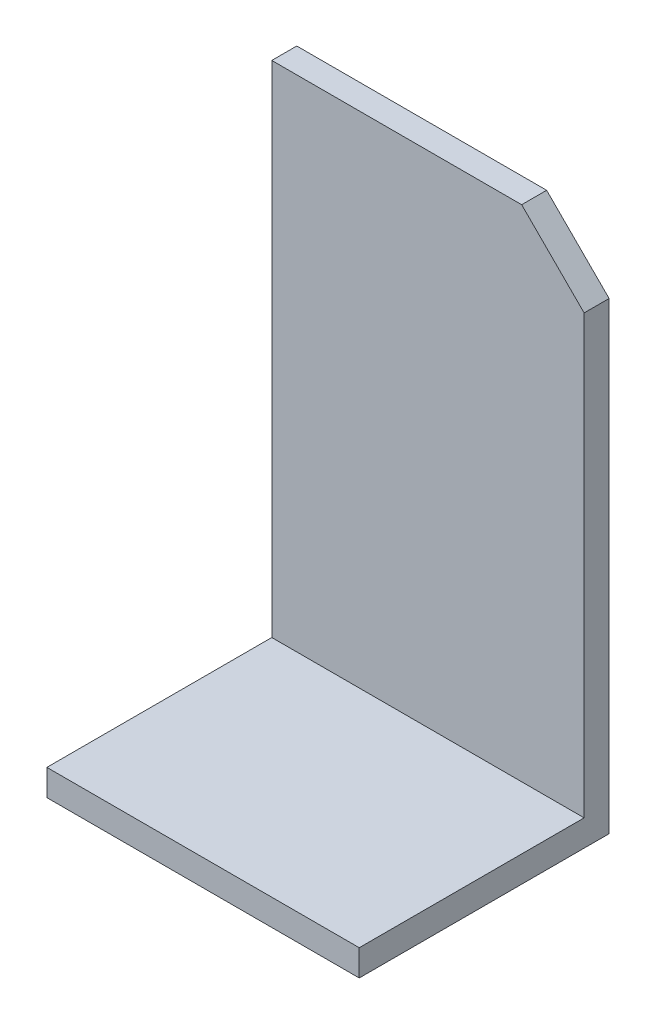
ISO-10303-21;
HEADER;
FILE_DESCRIPTION(('STEP AP214'),'2;1');
FILE_NAME('part.step','',(''),(''),'','','');
FILE_SCHEMA(('AUTOMOTIVE_DESIGN { 1 0 10303 214 1 1 1 1 }'));
ENDSEC;
DATA;
#1=APPLICATION_CONTEXT('core data for automotive mechanical design processes');
#2=APPLICATION_PROTOCOL_DEFINITION('international standard','automotive_design',2000,#1);
#3=PRODUCT_CONTEXT('',#1,'mechanical');
#4=PRODUCT('Part','Part','',(#3));
#5=PRODUCT_RELATED_PRODUCT_CATEGORY('part','',(#4));
#6=PRODUCT_DEFINITION_FORMATION('','',#4);
#7=PRODUCT_DEFINITION_CONTEXT('part definition',#1,'design');
#8=PRODUCT_DEFINITION('design','',#6,#7);
#9=PRODUCT_DEFINITION_SHAPE('','',#8);
#10=(LENGTH_UNIT() NAMED_UNIT(*) SI_UNIT(.MILLI.,.METRE.));
#11=(NAMED_UNIT(*) PLANE_ANGLE_UNIT() SI_UNIT($,.RADIAN.));
#12=(NAMED_UNIT(*) SI_UNIT($,.STERADIAN.) SOLID_ANGLE_UNIT());
#13=UNCERTAINTY_MEASURE_WITH_UNIT(LENGTH_MEASURE(1.E-05),#10,'distance_accuracy_value','');
#14=(GEOMETRIC_REPRESENTATION_CONTEXT(3) GLOBAL_UNCERTAINTY_ASSIGNED_CONTEXT((#13)) GLOBAL_UNIT_ASSIGNED_CONTEXT((#10,
#11,#12)) REPRESENTATION_CONTEXT('',''));
#15=CARTESIAN_POINT('',(0.,0.,0.));
#16=DIRECTION('',(0.,0.,1.));
#17=DIRECTION('',(1.,0.,0.));
#18=AXIS2_PLACEMENT_3D('',#15,#16,#17);
#19=CARTESIAN_POINT('',(0.72167930040457,-1.5105,0.2));
#20=DIRECTION('',(0.,0.,1.));
#21=DIRECTION('',(0.,-1.,0.));
#22=AXIS2_PLACEMENT_3D('',#19,#20,#21);
#23=PLANE('',#22);
#24=DIRECTION('',(0.,-1.,0.));
#25=VECTOR('',#24,1.);
#26=CARTESIAN_POINT('',(0.59667930040457,-1.36847101449275,0.2));
#27=LINE('',#26,#25);
#28=CARTESIAN_POINT('',(0.59667930040457,-1.5,0.2));
#29=VERTEX_POINT('',#28);
#30=CARTESIAN_POINT('',(0.59667930040457,-1.521,0.2));
#31=VERTEX_POINT('',#30);
#32=EDGE_CURVE('E124',#29,#31,#27,.T.);
#33=ORIENTED_EDGE('',*,*,#32,.T.);
#34=DIRECTION('',(1.,0.,0.));
#35=VECTOR('',#34,1.);
#36=CARTESIAN_POINT('',(0.72167930040457,-1.521,0.2));
#37=LINE('',#36,#35);
#38=CARTESIAN_POINT('',(0.84667930040457,-1.521,0.2));
#39=VERTEX_POINT('',#38);
#40=EDGE_CURVE('E95',#31,#39,#37,.T.);
#41=ORIENTED_EDGE('',*,*,#40,.T.);
#42=DIRECTION('',(0.,-1.,0.));
#43=VECTOR('',#42,1.);
#44=CARTESIAN_POINT('',(0.846679300404568,-1.39066637478108,0.2));
#45=LINE('',#44,#43);
#46=CARTESIAN_POINT('',(0.846679300404569,-1.5,0.2));
#47=VERTEX_POINT('',#46);
#48=EDGE_CURVE('E93',#47,#39,#45,.T.);
#49=ORIENTED_EDGE('',*,*,#48,.F.);
#50=DIRECTION('',(1.,0.,0.));
#51=VECTOR('',#50,1.);
#52=CARTESIAN_POINT('',(0.72167930040457,-1.5,0.2));
#53=LINE('',#52,#51);
#54=EDGE_CURVE('E21',#29,#47,#53,.T.);
#55=ORIENTED_EDGE('',*,*,#54,.F.);
#56=EDGE_LOOP('',(#33,#41,#49,#55));
#57=FACE_BOUND('',#56,.T.);
#58=ADVANCED_FACE('F17',(#57),#23,.T.);
#59=CARTESIAN_POINT('',(0.718390642915422,-1.30501737448108,0.02));
#60=DIRECTION('',(0.,0.,1.));
#61=DIRECTION('',(0.,-1.,0.));
#62=AXIS2_PLACEMENT_3D('',#59,#60,#61);
#63=PLANE('',#62);
#64=DIRECTION('',(1.,0.,0.));
#65=VECTOR('',#64,1.);
#66=CARTESIAN_POINT('',(0.696679300404569,-1.1,0.02));
#67=LINE('',#66,#65);
#68=CARTESIAN_POINT('',(0.59667930040457,-1.1,0.02));
#69=VERTEX_POINT('',#68);
#70=CARTESIAN_POINT('',(0.796679300404568,-1.1,0.02));
#71=VERTEX_POINT('',#70);
#72=EDGE_CURVE('E50',#69,#71,#67,.T.);
#73=ORIENTED_EDGE('',*,*,#72,.F.);
#74=DIRECTION('',(0.,-1.,0.));
#75=VECTOR('',#74,1.);
#76=CARTESIAN_POINT('',(0.59667930040457,-1.36847101449275,0.02));
#77=LINE('',#76,#75);
#78=CARTESIAN_POINT('',(0.59667930040457,-1.5,0.02));
#79=VERTEX_POINT('',#78);
#80=EDGE_CURVE('E129',#69,#79,#77,.T.);
#81=ORIENTED_EDGE('',*,*,#80,.T.);
#82=DIRECTION('',(-1.,0.,0.));
#83=VECTOR('',#82,1.);
#84=CARTESIAN_POINT('',(0.72167930040457,-1.5,0.02));
#85=LINE('',#84,#83);
#86=CARTESIAN_POINT('',(0.846679300404569,-1.5,0.02));
#87=VERTEX_POINT('',#86);
#88=EDGE_CURVE('E11',#87,#79,#85,.T.);
#89=ORIENTED_EDGE('',*,*,#88,.F.);
#90=DIRECTION('',(0.,-1.,0.));
#91=VECTOR('',#90,1.);
#92=CARTESIAN_POINT('',(0.846679300404568,-1.39066637478108,0.02));
#93=LINE('',#92,#91);
#94=CARTESIAN_POINT('',(0.846679300404569,-1.15,0.02));
#95=VERTEX_POINT('',#94);
#96=EDGE_CURVE('E104',#95,#87,#93,.T.);
#97=ORIENTED_EDGE('',*,*,#96,.F.);
#98=DIRECTION('',(0.707106781186548,-0.707106781186547,0.));
#99=VECTOR('',#98,1.);
#100=CARTESIAN_POINT('',(0.821679300404569,-1.125,0.02));
#101=LINE('',#100,#99);
#102=EDGE_CURVE('E40',#71,#95,#101,.T.);
#103=ORIENTED_EDGE('',*,*,#102,.F.);
#104=EDGE_LOOP('',(#73,#81,#89,#97,#103));
#105=FACE_BOUND('',#104,.T.);
#106=ADVANCED_FACE('F19',(#105),#63,.T.);
#107=CARTESIAN_POINT('',(0.72167930040457,-1.5,0.11));
#108=DIRECTION('',(0.,1.,0.));
#109=DIRECTION('',(1.,0.,0.));
#110=AXIS2_PLACEMENT_3D('',#107,#108,#109);
#111=PLANE('',#110);
#112=DIRECTION('',(0.,0.,1.));
#113=VECTOR('',#112,1.);
#114=CARTESIAN_POINT('',(0.59667930040457,-1.5,0.0420289855072462));
#115=LINE('',#114,#113);
#116=EDGE_CURVE('E87',#79,#29,#115,.T.);
#117=ORIENTED_EDGE('',*,*,#116,.T.);
#118=ORIENTED_EDGE('',*,*,#54,.T.);
#119=DIRECTION('',(0.,0.,1.));
#120=VECTOR('',#119,1.);
#121=CARTESIAN_POINT('',(0.846679300404569,-1.5,0.0448336252189141));
#122=LINE('',#121,#120);
#123=EDGE_CURVE('E84',#87,#47,#122,.T.);
#124=ORIENTED_EDGE('',*,*,#123,.F.);
#125=ORIENTED_EDGE('',*,*,#88,.T.);
#126=EDGE_LOOP('',(#117,#118,#124,#125));
#127=FACE_BOUND('',#126,.T.);
#128=ADVANCED_FACE('F82',(#127),#111,.T.);
#129=CARTESIAN_POINT('',(0.821679300404569,-1.125,0.01));
#130=DIRECTION('',(0.707106781186547,0.707106781186548,0.));
#131=DIRECTION('',(0.,0.,-1.));
#132=AXIS2_PLACEMENT_3D('',#129,#130,#131);
#133=PLANE('',#132);
#134=DIRECTION('',(0.,0.,1.));
#135=VECTOR('',#134,1.);
#136=CARTESIAN_POINT('',(0.846679300404567,-1.15,0.0448336252189141));
#137=LINE('',#136,#135);
#138=CARTESIAN_POINT('',(0.846679300404569,-1.15,0.));
#139=VERTEX_POINT('',#138);
#140=EDGE_CURVE('E118',#139,#95,#137,.T.);
#141=ORIENTED_EDGE('',*,*,#140,.F.);
#142=DIRECTION('',(-0.707106781186541,0.707106781186554,0.));
#143=VECTOR('',#142,1.);
#144=CARTESIAN_POINT('',(0.846679300404568,-1.15,0.));
#145=LINE('',#144,#143);
#146=CARTESIAN_POINT('',(0.796679300404568,-1.1,0.));
#147=VERTEX_POINT('',#146);
#148=EDGE_CURVE('E179',#139,#147,#145,.T.);
#149=ORIENTED_EDGE('',*,*,#148,.T.);
#150=DIRECTION('',(0.,0.,-1.));
#151=VECTOR('',#150,1.);
#152=CARTESIAN_POINT('',(0.796679300404568,-1.1,0.01));
#153=LINE('',#152,#151);
#154=EDGE_CURVE('E130',#71,#147,#153,.T.);
#155=ORIENTED_EDGE('',*,*,#154,.F.);
#156=ORIENTED_EDGE('',*,*,#102,.T.);
#157=EDGE_LOOP('',(#141,#149,#155,#156));
#158=FACE_BOUND('',#157,.T.);
#159=ADVANCED_FACE('F141',(#158),#133,.T.);
#160=CARTESIAN_POINT('',(0.696679300404569,-1.1,0.01));
#161=DIRECTION('',(0.,1.,0.));
#162=DIRECTION('',(1.,0.,0.));
#163=AXIS2_PLACEMENT_3D('',#160,#161,#162);
#164=PLANE('',#163);
#165=ORIENTED_EDGE('',*,*,#154,.T.);
#166=DIRECTION('',(-1.,0.,0.));
#167=VECTOR('',#166,1.);
#168=CARTESIAN_POINT('',(0.718495863065486,-1.1,0.));
#169=LINE('',#168,#167);
#170=CARTESIAN_POINT('',(0.59667930040457,-1.1,0.));
#171=VERTEX_POINT('',#170);
#172=EDGE_CURVE('E177',#147,#171,#169,.T.);
#173=ORIENTED_EDGE('',*,*,#172,.T.);
#174=DIRECTION('',(0.,0.,1.));
#175=VECTOR('',#174,1.);
#176=CARTESIAN_POINT('',(0.59667930040457,-1.1,0.0420289855072462));
#177=LINE('',#176,#175);
#178=EDGE_CURVE('E134',#171,#69,#177,.T.);
#179=ORIENTED_EDGE('',*,*,#178,.T.);
#180=ORIENTED_EDGE('',*,*,#72,.T.);
#181=EDGE_LOOP('',(#165,#173,#179,#180));
#182=FACE_BOUND('',#181,.T.);
#183=ADVANCED_FACE('F175',(#182),#164,.T.);
#184=CARTESIAN_POINT('',(0.59667930040457,-1.36847101449275,0.0420289855072462));
#185=DIRECTION('',(1.,0.,0.));
#186=DIRECTION('',(0.,-1.,0.));
#187=AXIS2_PLACEMENT_3D('',#184,#185,#186);
#188=PLANE('',#187);
#189=DIRECTION('',(0.,0.,1.));
#190=VECTOR('',#189,1.);
#191=CARTESIAN_POINT('',(0.59667930040457,-1.521,0.1));
#192=LINE('',#191,#190);
#193=CARTESIAN_POINT('',(0.59667930040457,-1.521,0.));
#194=VERTEX_POINT('',#193);
#195=EDGE_CURVE('E117',#194,#31,#192,.T.);
#196=ORIENTED_EDGE('',*,*,#195,.T.);
#197=ORIENTED_EDGE('',*,*,#32,.F.);
#198=ORIENTED_EDGE('',*,*,#116,.F.);
#199=ORIENTED_EDGE('',*,*,#80,.F.);
#200=ORIENTED_EDGE('',*,*,#178,.F.);
#201=DIRECTION('',(0.,-1.,0.));
#202=VECTOR('',#201,1.);
#203=CARTESIAN_POINT('',(0.59667930040457,-1.31559112123515,0.));
#204=LINE('',#203,#202);
#205=EDGE_CURVE('E184',#171,#194,#204,.T.);
#206=ORIENTED_EDGE('',*,*,#205,.T.);
#207=EDGE_LOOP('',(#196,#197,#198,#199,#200,#206));
#208=FACE_BOUND('',#207,.T.);
#209=ADVANCED_FACE('F152',(#208),#188,.F.);
#210=CARTESIAN_POINT('',(0.72167930040457,-1.521,0.1));
#211=DIRECTION('',(0.,1.,0.));
#212=DIRECTION('',(1.,0.,0.));
#213=AXIS2_PLACEMENT_3D('',#210,#211,#212);
#214=PLANE('',#213);
#215=DIRECTION('',(1.,0.,0.));
#216=VECTOR('',#215,1.);
#217=CARTESIAN_POINT('',(0.718495863065486,-1.521,0.));
#218=LINE('',#217,#216);
#219=CARTESIAN_POINT('',(0.84667930040457,-1.521,0.));
#220=VERTEX_POINT('',#219);
#221=EDGE_CURVE('E190',#194,#220,#218,.T.);
#222=ORIENTED_EDGE('',*,*,#221,.T.);
#223=DIRECTION('',(0.,0.,-1.));
#224=VECTOR('',#223,1.);
#225=CARTESIAN_POINT('',(0.846679300404569,-1.521,0.0448336252189141));
#226=LINE('',#225,#224);
#227=EDGE_CURVE('E100',#39,#220,#226,.T.);
#228=ORIENTED_EDGE('',*,*,#227,.F.);
#229=ORIENTED_EDGE('',*,*,#40,.F.);
#230=ORIENTED_EDGE('',*,*,#195,.F.);
#231=EDGE_LOOP('',(#222,#228,#229,#230));
#232=FACE_BOUND('',#231,.T.);
#233=ADVANCED_FACE('F202',(#232),#214,.F.);
#234=CARTESIAN_POINT('',(0.846679300404568,-1.39066637478108,0.0448336252189141));
#235=DIRECTION('',(1.,0.,0.));
#236=DIRECTION('',(0.,1.,0.));
#237=AXIS2_PLACEMENT_3D('',#234,#235,#236);
#238=PLANE('',#237);
#239=ORIENTED_EDGE('',*,*,#96,.T.);
#240=ORIENTED_EDGE('',*,*,#123,.T.);
#241=ORIENTED_EDGE('',*,*,#48,.T.);
#242=ORIENTED_EDGE('',*,*,#227,.T.);
#243=DIRECTION('',(0.,1.,0.));
#244=VECTOR('',#243,1.);
#245=CARTESIAN_POINT('',(0.84667930040457,-1.31559112123515,0.));
#246=LINE('',#245,#244);
#247=EDGE_CURVE('E111',#220,#139,#246,.T.);
#248=ORIENTED_EDGE('',*,*,#247,.T.);
#249=ORIENTED_EDGE('',*,*,#140,.T.);
#250=EDGE_LOOP('',(#239,#240,#241,#242,#248,#249));
#251=FACE_BOUND('',#250,.T.);
#252=ADVANCED_FACE('F102',(#251),#238,.T.);
#253=CARTESIAN_POINT('',(0.718495863065486,-1.31559112123515,0.));
#254=DIRECTION('',(0.,0.,1.));
#255=DIRECTION('',(0.,-1.,0.));
#256=AXIS2_PLACEMENT_3D('',#253,#254,#255);
#257=PLANE('',#256);
#258=ORIENTED_EDGE('',*,*,#221,.F.);
#259=ORIENTED_EDGE('',*,*,#205,.F.);
#260=ORIENTED_EDGE('',*,*,#172,.F.);
#261=ORIENTED_EDGE('',*,*,#148,.F.);
#262=ORIENTED_EDGE('',*,*,#247,.F.);
#263=EDGE_LOOP('',(#258,#259,#260,#261,#262));
#264=FACE_BOUND('',#263,.T.);
#265=ADVANCED_FACE('F183',(#264),#257,.F.);
#266=CLOSED_SHELL('',(#58,#106,#128,#159,#183,#209,#233,#252,#265));
#267=MANIFOLD_SOLID_BREP('B1',#266);
#268=ADVANCED_BREP_SHAPE_REPRESENTATION('',(#18,#267),#14);
#269=SHAPE_DEFINITION_REPRESENTATION(#9,#268);
ENDSEC;
END-ISO-10303-21;
